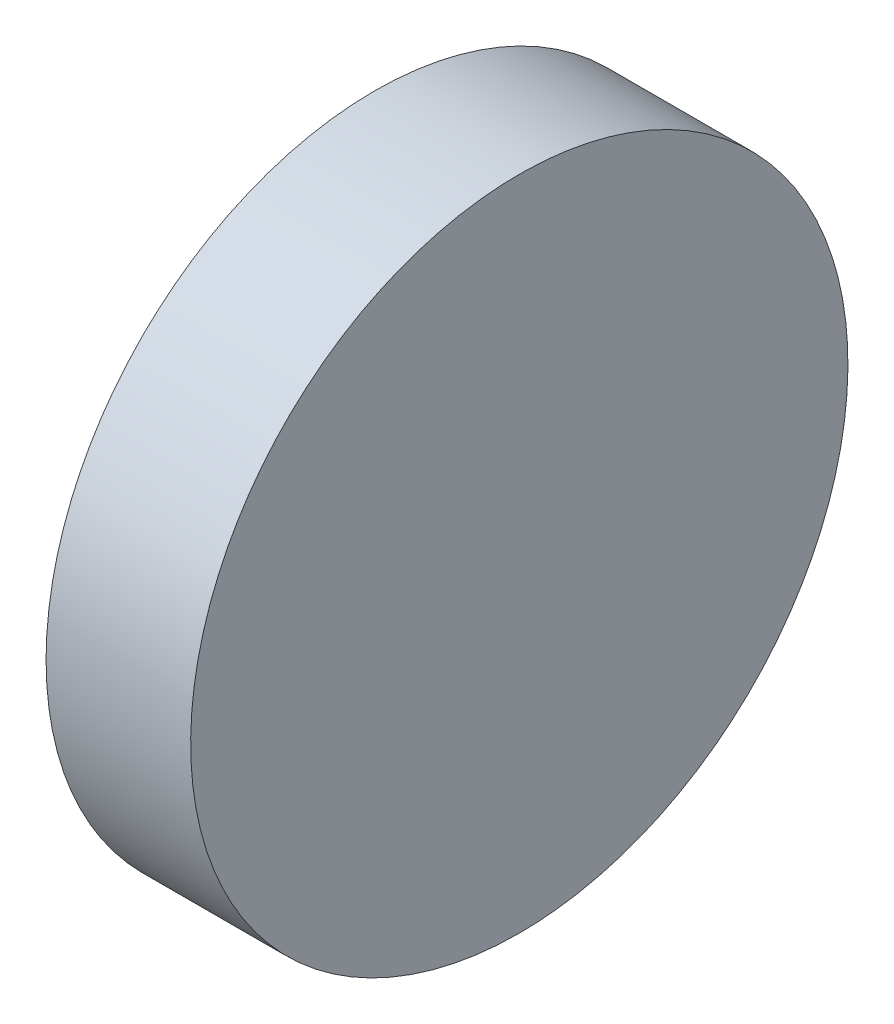
ISO-10303-21;
HEADER;
FILE_DESCRIPTION(('STEP AP214'),'2;1');
FILE_NAME('part.step','',(''),(''),'','','');
FILE_SCHEMA(('AUTOMOTIVE_DESIGN { 1 0 10303 214 1 1 1 1 }'));
ENDSEC;
DATA;
#1=APPLICATION_CONTEXT('core data for automotive mechanical design processes');
#2=APPLICATION_PROTOCOL_DEFINITION('international standard','automotive_design',2000,#1);
#3=PRODUCT_CONTEXT('',#1,'mechanical');
#4=PRODUCT('Part','Part','',(#3));
#5=PRODUCT_RELATED_PRODUCT_CATEGORY('part','',(#4));
#6=PRODUCT_DEFINITION_FORMATION('','',#4);
#7=PRODUCT_DEFINITION_CONTEXT('part definition',#1,'design');
#8=PRODUCT_DEFINITION('design','',#6,#7);
#9=PRODUCT_DEFINITION_SHAPE('','',#8);
#10=(LENGTH_UNIT() NAMED_UNIT(*) SI_UNIT(.MILLI.,.METRE.));
#11=(NAMED_UNIT(*) PLANE_ANGLE_UNIT() SI_UNIT($,.RADIAN.));
#12=(NAMED_UNIT(*) SI_UNIT($,.STERADIAN.) SOLID_ANGLE_UNIT());
#13=UNCERTAINTY_MEASURE_WITH_UNIT(LENGTH_MEASURE(1.E-05),#10,'distance_accuracy_value','');
#14=(GEOMETRIC_REPRESENTATION_CONTEXT(3) GLOBAL_UNCERTAINTY_ASSIGNED_CONTEXT((#13)) GLOBAL_UNIT_ASSIGNED_CONTEXT((#10,
#11,#12)) REPRESENTATION_CONTEXT('',''));
#15=CARTESIAN_POINT('',(0.,0.,0.));
#16=DIRECTION('',(0.,0.,1.));
#17=DIRECTION('',(1.,0.,0.));
#18=AXIS2_PLACEMENT_3D('',#15,#16,#17);
#19=CARTESIAN_POINT('',(-171.379588267492,-8.22627416997865,100.));
#20=CARTESIAN_POINT('',(-171.379588267492,-8.22627416997865,100.53840391905));
#21=CARTESIAN_POINT('',(-171.379588267492,-8.12021785485827,101.615211757149));
#22=CARTESIAN_POINT('',(-171.379588267492,-7.64907796388612,103.168351832291));
#23=CARTESIAN_POINT('',(-171.379588267492,-6.88398829641409,104.599733923351));
#24=CARTESIAN_POINT('',(-171.379588267492,-5.85435081929597,105.854350819297));
#25=CARTESIAN_POINT('',(-171.379588267492,-4.59973392335003,106.883988296415));
#26=CARTESIAN_POINT('',(-171.379588267492,-3.16835183229019,107.649077963887));
#27=CARTESIAN_POINT('',(-171.379588267492,-1.61521175714759,108.120217854859));
#28=CARTESIAN_POINT('',(-171.379588267492,1.04694070344487E-12,108.27930232754));
#29=CARTESIAN_POINT('',(-171.379588267492,1.61521175714969,108.120217854859));
#30=CARTESIAN_POINT('',(-171.379588267492,3.16835183229228,107.649077963887));
#31=CARTESIAN_POINT('',(-171.379588267492,4.59973392335212,106.883988296415));
#32=CARTESIAN_POINT('',(-171.379588267492,5.85435081929807,105.854350819297));
#33=CARTESIAN_POINT('',(-171.379588267492,6.88398829641619,104.599733923351));
#34=CARTESIAN_POINT('',(-171.379588267492,7.64907796388822,103.168351832291));
#35=CARTESIAN_POINT('',(-171.379588267492,8.12021785486037,101.615211757149));
#36=CARTESIAN_POINT('',(-171.379588267492,8.27930232754094,100.));
#37=CARTESIAN_POINT('',(-171.379588267492,8.12021785486037,98.3847882428513));
#38=CARTESIAN_POINT('',(-171.379588267492,7.64907796388822,96.8316481677087));
#39=CARTESIAN_POINT('',(-171.379588267492,6.88398829641619,95.4002660766489));
#40=CARTESIAN_POINT('',(-171.379588267492,5.85435081929807,94.145649180703));
#41=CARTESIAN_POINT('',(-171.379588267492,4.59973392335213,93.1160117035848));
#42=CARTESIAN_POINT('',(-171.379588267492,3.16835183229228,92.3509220361129));
#43=CARTESIAN_POINT('',(-171.379588267492,1.61521175714969,91.8797821451406));
#44=CARTESIAN_POINT('',(-171.379588267492,1.04604193531338E-12,91.7206976724601));
#45=CARTESIAN_POINT('',(-171.379588267492,-1.61521175714758,91.8797821451406));
#46=CARTESIAN_POINT('',(-171.379588267492,-3.16835183229019,92.3509220361128));
#47=CARTESIAN_POINT('',(-171.379588267492,-4.59973392335002,93.1160117035848));
#48=CARTESIAN_POINT('',(-171.379588267492,-5.85435081929598,94.145649180703));
#49=CARTESIAN_POINT('',(-171.379588267492,-6.88398829641409,95.4002660766489));
#50=CARTESIAN_POINT('',(-171.379588267492,-7.64907796388612,96.8316481677087));
#51=CARTESIAN_POINT('',(-171.379588267492,-8.12021785485827,98.3847882428514));
#52=CARTESIAN_POINT('',(-171.379588267492,-8.22627416997865,99.4615960809504));
#53=CARTESIAN_POINT('',(-171.379588267492,-8.22627416997865,100.));
#54=B_SPLINE_CURVE_WITH_KNOTS('',3,(#19,#20,#21,#22,#23,#24,#25,#26,#27,#28,#29,#30,#31,#32,#33,
#34,#35,#36,#37,#38,#39,#40,#41,#42,#43,#44,#45,#46,#47,#48,#49,#50,#51,#52,#53),.UNSPECIFIED.,
.T.,.F.,(4,1,1,1,1,1,1,1,1,1,1,1,1,1,1,1,1,1,1,1,1,1,1,1,1,1,1,1,1,1,1,1,4),(0.,
0.0312499999999999,0.0625000000000002,0.0937499999999998,0.125,0.15625,0.1875,0.21875,0.25,
0.28125,0.3125,0.34375,0.375,0.40625,0.4375,0.46875,0.5,0.53125,0.5625,0.59375,0.625,0.65625,
0.6875,0.71875,0.75,0.78125,0.8125,0.84375,0.875,0.90625,0.9375,0.96875,1.),.UNSPECIFIED.);
#55=DIRECTION('',(-1.,0.,0.));
#56=VECTOR('',#55,1.);
#57=SURFACE_OF_LINEAR_EXTRUSION('',#54,#56);
#58=CARTESIAN_POINT('',(-171.379588267492,-8.22627416997865,100.));
#59=CARTESIAN_POINT('',(-171.379588267492,-8.22627416997865,100.53840391905));
#60=CARTESIAN_POINT('',(-171.379588267492,-8.12021785485827,101.615211757149));
#61=CARTESIAN_POINT('',(-171.379588267492,-7.64907796388612,103.168351832291));
#62=CARTESIAN_POINT('',(-171.379588267492,-6.88398829641409,104.599733923351));
#63=CARTESIAN_POINT('',(-171.379588267492,-5.85435081929597,105.854350819297));
#64=CARTESIAN_POINT('',(-171.379588267492,-4.59973392335003,106.883988296415));
#65=CARTESIAN_POINT('',(-171.379588267492,-3.16835183229019,107.649077963887));
#66=CARTESIAN_POINT('',(-171.379588267492,-1.61521175714759,108.120217854859));
#67=CARTESIAN_POINT('',(-171.379588267492,1.04694070344487E-12,108.27930232754));
#68=CARTESIAN_POINT('',(-171.379588267492,1.61521175714969,108.120217854859));
#69=CARTESIAN_POINT('',(-171.379588267492,3.16835183229228,107.649077963887));
#70=CARTESIAN_POINT('',(-171.379588267492,4.59973392335212,106.883988296415));
#71=CARTESIAN_POINT('',(-171.379588267492,5.85435081929807,105.854350819297));
#72=CARTESIAN_POINT('',(-171.379588267492,6.88398829641619,104.599733923351));
#73=CARTESIAN_POINT('',(-171.379588267492,7.64907796388822,103.168351832291));
#74=CARTESIAN_POINT('',(-171.379588267492,8.12021785486037,101.615211757149));
#75=CARTESIAN_POINT('',(-171.379588267492,8.27930232754094,100.));
#76=CARTESIAN_POINT('',(-171.379588267492,8.12021785486037,98.3847882428513));
#77=CARTESIAN_POINT('',(-171.379588267492,7.64907796388822,96.8316481677087));
#78=CARTESIAN_POINT('',(-171.379588267492,6.88398829641619,95.4002660766489));
#79=CARTESIAN_POINT('',(-171.379588267492,5.85435081929807,94.145649180703));
#80=CARTESIAN_POINT('',(-171.379588267492,4.59973392335213,93.1160117035848));
#81=CARTESIAN_POINT('',(-171.379588267492,3.16835183229228,92.3509220361129));
#82=CARTESIAN_POINT('',(-171.379588267492,1.61521175714969,91.8797821451406));
#83=CARTESIAN_POINT('',(-171.379588267492,1.04604193531338E-12,91.7206976724601));
#84=CARTESIAN_POINT('',(-171.379588267492,-1.61521175714758,91.8797821451406));
#85=CARTESIAN_POINT('',(-171.379588267492,-3.16835183229019,92.3509220361128));
#86=CARTESIAN_POINT('',(-171.379588267492,-4.59973392335002,93.1160117035848));
#87=CARTESIAN_POINT('',(-171.379588267492,-5.85435081929598,94.145649180703));
#88=CARTESIAN_POINT('',(-171.379588267492,-6.88398829641409,95.4002660766489));
#89=CARTESIAN_POINT('',(-171.379588267492,-7.64907796388612,96.8316481677087));
#90=CARTESIAN_POINT('',(-171.379588267492,-8.12021785485827,98.3847882428514));
#91=CARTESIAN_POINT('',(-171.379588267492,-8.22627416997865,99.4615960809504));
#92=CARTESIAN_POINT('',(-171.379588267492,-8.22627416997865,100.));
#93=B_SPLINE_CURVE_WITH_KNOTS('',3,(#58,#59,#60,#61,#62,#63,#64,#65,#66,#67,#68,#69,#70,#71,#72,
#73,#74,#75,#76,#77,#78,#79,#80,#81,#82,#83,#84,#85,#86,#87,#88,#89,#90,#91,#92),.UNSPECIFIED.,
.T.,.F.,(4,1,1,1,1,1,1,1,1,1,1,1,1,1,1,1,1,1,1,1,1,1,1,1,1,1,1,1,1,1,1,1,4),(0.,
0.0312499999999999,0.0625000000000002,0.0937499999999998,0.125,0.15625,0.1875,0.21875,0.25,
0.28125,0.3125,0.34375,0.375,0.40625,0.4375,0.46875,0.5,0.53125,0.5625,0.59375,0.625,0.65625,
0.6875,0.71875,0.75,0.78125,0.8125,0.84375,0.875,0.90625,0.9375,0.96875,1.),.UNSPECIFIED.);
#94=CARTESIAN_POINT('',(-171.379588267492,-8.22627416997865,100.));
#95=VERTEX_POINT('',#94);
#96=EDGE_CURVE('E9',#95,#95,#93,.T.);
#97=ORIENTED_EDGE('',*,*,#96,.T.);
#98=EDGE_LOOP('',(#97));
#99=FACE_BOUND('',#98,.T.);
#100=CARTESIAN_POINT('',(-174.999,-8.22627416997865,100.));
#101=CARTESIAN_POINT('',(-174.999,-8.22627414205933,99.8653981937389));
#102=CARTESIAN_POINT('',(-174.999,-8.22295987055064,99.7307973670926));
#103=CARTESIAN_POINT('',(-174.999,-8.20973470024278,99.461919000039));
#104=CARTESIAN_POINT('',(-174.999,-8.19982375020194,99.3276414621511));
#105=CARTESIAN_POINT('',(-174.999,-8.17343708370963,99.0597331007838));
#106=CARTESIAN_POINT('',(-174.999,-8.15696136725815,98.9261022773044));
#107=CARTESIAN_POINT('',(-174.999,-8.11747680903288,98.6598099515152));
#108=CARTESIAN_POINT('',(-174.999,-8.09446801800827,98.527148441684));
#109=CARTESIAN_POINT('',(-174.999,-8.04194921894441,98.2631186046874));
#110=CARTESIAN_POINT('',(-174.999,-8.01243921090516,98.131750277522));
#111=CARTESIAN_POINT('',(-174.999,-7.94701251759616,97.87061814284));
#112=CARTESIAN_POINT('',(-174.999,-7.91109578256185,97.7408543477951));
#113=CARTESIAN_POINT('',(-174.999,-7.8329498197329,97.4832416321854));
#114=CARTESIAN_POINT('',(-174.999,-7.79072059193825,97.3553927116206));
#115=CARTESIAN_POINT('',(-174.999,-7.7000436575456,97.1019201523597));
#116=CARTESIAN_POINT('',(-174.999,-7.6515959992542,96.9762964963857));
#117=CARTESIAN_POINT('',(-174.999,-7.54857666968475,96.7275858337261));
#118=CARTESIAN_POINT('',(-174.999,-7.49400499840669,96.6044988270404));
#119=CARTESIAN_POINT('',(-174.999,-7.37889110803985,96.3611483862609));
#120=CARTESIAN_POINT('',(-174.999,-7.31834884257581,96.2408849741076));
#121=CARTESIAN_POINT('',(-174.999,-7.19144668496832,96.0034677360499));
#122=CARTESIAN_POINT('',(-174.999,-7.12508679282486,95.8863139101454));
#123=CARTESIAN_POINT('',(-174.999,-6.9867021470647,95.655401947258));
#124=CARTESIAN_POINT('',(-174.999,-6.91467743745568,95.5416437839049));
#125=CARTESIAN_POINT('',(-174.999,-6.76511655215715,95.3178101010976));
#126=CARTESIAN_POINT('',(-174.999,-6.68758037646764,95.2077345816434));
#127=CARTESIAN_POINT('',(-174.999,-6.52720305136949,94.9915176572796));
#128=CARTESIAN_POINT('',(-174.999,-6.44436186075708,94.8853762829364));
#129=CARTESIAN_POINT('',(-174.999,-6.27358028709991,94.6772783333297));
#130=CARTESIAN_POINT('',(-174.999,-6.18563990405515,94.5753217580661));
#131=CARTESIAN_POINT('',(-174.999,-6.00486559126254,94.3758442088999));
#132=CARTESIAN_POINT('',(-174.999,-5.91203169953222,94.2783232005485));
#133=CARTESIAN_POINT('',(-174.999,-5.72167679945045,94.0879683004667));
#134=CARTESIAN_POINT('',(-174.999,-5.624155791099,93.9951344087364));
#135=CARTESIAN_POINT('',(-174.999,-5.42467824193281,93.8143600959438));
#136=CARTESIAN_POINT('',(-174.999,-5.32272166666924,93.726419712899));
#137=CARTESIAN_POINT('',(-174.999,-5.11462371706252,93.5556381392419));
#138=CARTESIAN_POINT('',(-174.999,-5.00848234271936,93.4727969486294));
#139=CARTESIAN_POINT('',(-174.999,-4.79226541835554,93.3124196235313));
#140=CARTESIAN_POINT('',(-174.999,-4.68218989890128,93.2348834478418));
#141=CARTESIAN_POINT('',(-174.999,-4.45835621609415,93.0853225625432));
#142=CARTESIAN_POINT('',(-174.999,-4.34459805274128,93.0132978529342));
#143=CARTESIAN_POINT('',(-174.999,-4.11368608985322,92.8749132071741));
#144=CARTESIAN_POINT('',(-174.999,-3.99653226394796,92.8085533150306));
#145=CARTESIAN_POINT('',(-174.999,-3.75911502589239,92.6816511574232));
#146=CARTESIAN_POINT('',(-174.999,-3.63885161374208,92.6211088919593));
#147=CARTESIAN_POINT('',(-174.999,-3.3955011729545,92.505995001592));
#148=CARTESIAN_POINT('',(-174.999,-3.27241416625786,92.4514233303134));
#149=CARTESIAN_POINT('',(-174.999,-3.02370350362827,92.3484040007455));
#150=CARTESIAN_POINT('',(-174.999,-2.89807984769534,92.2999563424561));
#151=CARTESIAN_POINT('',(-174.999,-2.64460728832227,92.2092794080579));
#152=CARTESIAN_POINT('',(-174.999,-2.51675836760424,92.1670501802557));
#153=CARTESIAN_POINT('',(-174.999,-2.25914565241318,92.0889042174474));
#154=CARTESIAN_POINT('',(-174.999,-2.12938185794015,92.0529874824413));
#155=CARTESIAN_POINT('',(-174.999,-1.86824972169578,91.9875607890552));
#156=CARTESIAN_POINT('',(-174.999,-1.73688139239612,91.9580507809106));
#157=CARTESIAN_POINT('',(-174.999,-1.47285156123039,91.9055319821345));
#158=CARTESIAN_POINT('',(-174.999,-1.34019005936432,91.8825231915031));
#159=CARTESIAN_POINT('',(-174.999,-1.0738977118139,91.8430386322036));
#160=CARTESIAN_POINT('',(-174.999,-0.940266858607795,91.8265629142847));
#161=CARTESIAN_POINT('',(-174.999,-0.672358578455166,91.8001762518015));
#162=CARTESIAN_POINT('',(-174.999,-0.538081151508645,91.7902653072372));
#163=CARTESIAN_POINT('',(-174.999,-0.269202481358767,91.7770401219673));
#164=CARTESIAN_POINT('',(-174.999,-0.134601240678862,91.7737258300203));
#165=CARTESIAN_POINT('',(-174.999,0.13460124068095,91.7737258300203));
#166=CARTESIAN_POINT('',(-174.999,0.269202481360855,91.7770401219673));
#167=CARTESIAN_POINT('',(-174.999,0.538081151510734,91.7902653072372));
#168=CARTESIAN_POINT('',(-174.999,0.672358578457255,91.8001762518015));
#169=CARTESIAN_POINT('',(-174.999,0.940266858609885,91.8265629142847));
#170=CARTESIAN_POINT('',(-174.999,1.07389771181599,91.8430386322036));
#171=CARTESIAN_POINT('',(-174.999,1.34019005936642,91.8825231915031));
#172=CARTESIAN_POINT('',(-174.999,1.47285156123248,91.9055319821346));
#173=CARTESIAN_POINT('',(-174.999,1.73688139239821,91.9580507809106));
#174=CARTESIAN_POINT('',(-174.999,1.86824972169787,91.9875607890552));
#175=CARTESIAN_POINT('',(-174.999,2.12938185794224,92.0529874824413));
#176=CARTESIAN_POINT('',(-174.999,2.25914565241527,92.0889042174474));
#177=CARTESIAN_POINT('',(-174.999,2.51675836760633,92.1670501802557));
#178=CARTESIAN_POINT('',(-174.999,2.64460728832435,92.2092794080579));
#179=CARTESIAN_POINT('',(-174.999,2.89807984769743,92.2999563424561));
#180=CARTESIAN_POINT('',(-174.999,3.02370350363036,92.3484040007455));
#181=CARTESIAN_POINT('',(-174.999,3.27241416625994,92.4514233303135));
#182=CARTESIAN_POINT('',(-174.999,3.39550117295659,92.5059950015921));
#183=CARTESIAN_POINT('',(-174.999,3.63885161374417,92.6211088919593));
#184=CARTESIAN_POINT('',(-174.999,3.75911502589448,92.6816511574232));
#185=CARTESIAN_POINT('',(-174.999,3.99653226395006,92.8085533150306));
#186=CARTESIAN_POINT('',(-174.999,4.11368608985531,92.874913207174));
#187=CARTESIAN_POINT('',(-174.999,4.34459805274338,93.0132978529342));
#188=CARTESIAN_POINT('',(-174.999,4.45835621609624,93.0853225625432));
#189=CARTESIAN_POINT('',(-174.999,4.68218989890337,93.2348834478418));
#190=CARTESIAN_POINT('',(-174.999,4.79226541835763,93.3124196235313));
#191=CARTESIAN_POINT('',(-174.999,5.00848234272146,93.4727969486294));
#192=CARTESIAN_POINT('',(-174.999,5.11462371706461,93.5556381392418));
#193=CARTESIAN_POINT('',(-174.999,5.32272166667134,93.726419712899));
#194=CARTESIAN_POINT('',(-174.999,5.42467824193491,93.8143600959438));
#195=CARTESIAN_POINT('',(-174.999,5.62415579110109,93.9951344087364));
#196=CARTESIAN_POINT('',(-174.999,5.72167679945255,94.0879683004667));
#197=CARTESIAN_POINT('',(-174.999,5.91203169953431,94.2783232005485));
#198=CARTESIAN_POINT('',(-174.999,6.00486559126462,94.3758442088999));
#199=CARTESIAN_POINT('',(-174.999,6.18563990405723,94.5753217580661));
#200=CARTESIAN_POINT('',(-174.999,6.273580287102,94.6772783333297));
#201=CARTESIAN_POINT('',(-174.999,6.44436186075918,94.8853762829364));
#202=CARTESIAN_POINT('',(-174.999,6.52720305137158,94.9915176572796));
#203=CARTESIAN_POINT('',(-174.999,6.68758037646974,95.2077345816434));
#204=CARTESIAN_POINT('',(-174.999,6.76511655215924,95.3178101010977));
#205=CARTESIAN_POINT('',(-174.999,6.91467743745777,95.5416437839048));
#206=CARTESIAN_POINT('',(-174.999,6.98670214706679,95.6554019472576));
#207=CARTESIAN_POINT('',(-174.999,7.12508679282698,95.8863139101457));
#208=CARTESIAN_POINT('',(-174.999,7.19144668497047,96.003467736051));
#209=CARTESIAN_POINT('',(-174.999,7.31834884257785,96.2408849741065));
#210=CARTESIAN_POINT('',(-174.999,7.37889110804174,96.3611483862569));
#211=CARTESIAN_POINT('',(-174.999,7.49400499840898,96.6044988270444));
#212=CARTESIAN_POINT('',(-174.999,7.54857666968758,96.7275858337411));
#213=CARTESIAN_POINT('',(-174.999,7.65159599925556,96.9762964963707));
#214=CARTESIAN_POINT('',(-174.999,7.70004365754492,97.1019201523036));
#215=CARTESIAN_POINT('',(-174.999,7.79072059194312,97.3553927116767));
#216=CARTESIAN_POINT('',(-174.999,7.83294981974533,97.4832416323947));
#217=CARTESIAN_POINT('',(-174.999,7.91109578255362,97.7408543475857));
#218=CARTESIAN_POINT('',(-174.999,7.9470125175597,97.8706181420588));
#219=CARTESIAN_POINT('',(-174.999,8.01243921094582,98.1317502783031));
#220=CARTESIAN_POINT('',(-174.999,8.04194921909043,98.2631186076028));
#221=CARTESIAN_POINT('',(-174.999,8.09446801786645,98.5271484387685));
#222=CARTESIAN_POINT('',(-174.999,8.11747680849787,98.6598099406346));
#223=CARTESIAN_POINT('',(-174.999,8.15696136779736,98.926102288185));
#224=CARTESIAN_POINT('',(-174.999,8.17343708571627,99.0597331413911));
#225=CARTESIAN_POINT('',(-174.999,8.19982374819951,99.3276414215437));
#226=CARTESIAN_POINT('',(-174.999,8.20973469276384,99.4619188484903));
#227=CARTESIAN_POINT('',(-174.999,8.22295987803373,99.7307975186402));
#228=CARTESIAN_POINT('',(-174.999,8.22627416998075,99.8653987593201));
#229=CARTESIAN_POINT('',(-174.999,8.22627416998075,100.13460124068));
#230=CARTESIAN_POINT('',(-174.999,8.22295987803373,100.26920248136));
#231=CARTESIAN_POINT('',(-174.999,8.20973469276384,100.53808115151));
#232=CARTESIAN_POINT('',(-174.999,8.19982374819951,100.672358578456));
#233=CARTESIAN_POINT('',(-174.999,8.17343708571627,100.940266858609));
#234=CARTESIAN_POINT('',(-174.999,8.15696136779737,101.073897711815));
#235=CARTESIAN_POINT('',(-174.999,8.11747680849787,101.340190059365));
#236=CARTESIAN_POINT('',(-174.999,8.09446801786645,101.472851561231));
#237=CARTESIAN_POINT('',(-174.999,8.04194921909042,101.736881392397));
#238=CARTESIAN_POINT('',(-174.999,8.01243921094582,101.868249721697));
#239=CARTESIAN_POINT('',(-174.999,7.9470125175597,102.129381857941));
#240=CARTESIAN_POINT('',(-174.999,7.91109578255362,102.259145652414));
#241=CARTESIAN_POINT('',(-174.999,7.83294981974533,102.516758367605));
#242=CARTESIAN_POINT('',(-174.999,7.79072059194312,102.644607288323));
#243=CARTESIAN_POINT('',(-174.999,7.70004365754493,102.898079847696));
#244=CARTESIAN_POINT('',(-174.999,7.65159599925556,103.023703503629));
#245=CARTESIAN_POINT('',(-174.999,7.54857666968758,103.272414166259));
#246=CARTESIAN_POINT('',(-174.999,7.49400499840898,103.395501172956));
#247=CARTESIAN_POINT('',(-174.999,7.37889110804174,103.638851613743));
#248=CARTESIAN_POINT('',(-174.999,7.31834884257785,103.759115025893));
#249=CARTESIAN_POINT('',(-174.999,7.19144668497046,103.996532263949));
#250=CARTESIAN_POINT('',(-174.999,7.12508679282697,104.113686089854));
#251=CARTESIAN_POINT('',(-174.999,6.98670214706678,104.344598052742));
#252=CARTESIAN_POINT('',(-174.999,6.91467743745777,104.458356216095));
#253=CARTESIAN_POINT('',(-174.999,6.76511655215924,104.682189898902));
#254=CARTESIAN_POINT('',(-174.999,6.68758037646973,104.792265418357));
#255=CARTESIAN_POINT('',(-174.999,6.52720305137157,105.00848234272));
#256=CARTESIAN_POINT('',(-174.999,6.44436186075917,105.114623717064));
#257=CARTESIAN_POINT('',(-174.999,6.273580287102,105.32272166667));
#258=CARTESIAN_POINT('',(-174.999,6.18563990405723,105.424678241934));
#259=CARTESIAN_POINT('',(-174.999,6.00486559126462,105.6241557911));
#260=CARTESIAN_POINT('',(-174.999,5.91203169953431,105.721676799451));
#261=CARTESIAN_POINT('',(-174.999,5.72167679945254,105.912031699533));
#262=CARTESIAN_POINT('',(-174.999,5.62415579110109,106.004865591264));
#263=CARTESIAN_POINT('',(-174.999,5.4246782419349,106.185639904056));
#264=CARTESIAN_POINT('',(-174.999,5.32272166667133,106.273580287101));
#265=CARTESIAN_POINT('',(-174.999,5.11462371706461,106.444361860758));
#266=CARTESIAN_POINT('',(-174.999,5.00848234272145,106.527203051371));
#267=CARTESIAN_POINT('',(-174.999,4.79226541835763,106.687580376469));
#268=CARTESIAN_POINT('',(-174.999,4.68218989890336,106.765116552158));
#269=CARTESIAN_POINT('',(-174.999,4.45835621609624,106.914677437457));
#270=CARTESIAN_POINT('',(-174.999,4.34459805274338,106.986702147066));
#271=CARTESIAN_POINT('',(-174.999,4.11368608985531,107.125086792826));
#272=CARTESIAN_POINT('',(-174.999,3.99653226395005,107.191446684969));
#273=CARTESIAN_POINT('',(-174.999,3.75911502589448,107.318348842577));
#274=CARTESIAN_POINT('',(-174.999,3.63885161374417,107.378891108041));
#275=CARTESIAN_POINT('',(-174.999,3.39550117295659,107.494004998408));
#276=CARTESIAN_POINT('',(-174.999,3.27241416625994,107.548576669686));
#277=CARTESIAN_POINT('',(-174.999,3.02370350363036,107.651595999254));
#278=CARTESIAN_POINT('',(-174.999,2.89807984769743,107.700043657544));
#279=CARTESIAN_POINT('',(-174.999,2.64460728832436,107.790720591942));
#280=CARTESIAN_POINT('',(-174.999,2.51675836760632,107.832949819744));
#281=CARTESIAN_POINT('',(-174.999,2.25914565241527,107.911095782553));
#282=CARTESIAN_POINT('',(-174.999,2.12938185794224,107.947012517559));
#283=CARTESIAN_POINT('',(-174.999,1.86824972169787,108.012439210945));
#284=CARTESIAN_POINT('',(-174.999,1.73688139239821,108.041949219089));
#285=CARTESIAN_POINT('',(-174.999,1.47285156123248,108.094468017865));
#286=CARTESIAN_POINT('',(-174.999,1.34019005936642,108.117476808497));
#287=CARTESIAN_POINT('',(-174.999,1.07389771181599,108.156961367796));
#288=CARTESIAN_POINT('',(-174.999,0.940266858609887,108.173437085715));
#289=CARTESIAN_POINT('',(-174.999,0.672358578457258,108.199823748198));
#290=CARTESIAN_POINT('',(-174.999,0.538081151510736,108.209734692763));
#291=CARTESIAN_POINT('',(-174.999,0.269202481360857,108.222959878033));
#292=CARTESIAN_POINT('',(-174.999,0.134601240680951,108.22627416998));
#293=CARTESIAN_POINT('',(-174.999,-0.134601240678861,108.22627416998));
#294=CARTESIAN_POINT('',(-174.999,-0.269202481358767,108.222959878033));
#295=CARTESIAN_POINT('',(-174.999,-0.538081151508646,108.209734692763));
#296=CARTESIAN_POINT('',(-174.999,-0.672358578455167,108.199823748198));
#297=CARTESIAN_POINT('',(-174.999,-0.940266858607797,108.173437085715));
#298=CARTESIAN_POINT('',(-174.999,-1.0738977118139,108.156961367796));
#299=CARTESIAN_POINT('',(-174.999,-1.34019005936433,108.117476808497));
#300=CARTESIAN_POINT('',(-174.999,-1.47285156123039,108.094468017865));
#301=CARTESIAN_POINT('',(-174.999,-1.73688139239612,108.041949219089));
#302=CARTESIAN_POINT('',(-174.999,-1.86824972169578,108.012439210945));
#303=CARTESIAN_POINT('',(-174.999,-2.12938185794015,107.947012517559));
#304=CARTESIAN_POINT('',(-174.999,-2.25914565241318,107.911095782553));
#305=CARTESIAN_POINT('',(-174.999,-2.51675836760424,107.832949819744));
#306=CARTESIAN_POINT('',(-174.999,-2.64460728832227,107.790720591942));
#307=CARTESIAN_POINT('',(-174.999,-2.89807984769534,107.700043657544));
#308=CARTESIAN_POINT('',(-174.999,-3.02370350362827,107.651595999254));
#309=CARTESIAN_POINT('',(-174.999,-3.27241416625785,107.548576669687));
#310=CARTESIAN_POINT('',(-174.999,-3.3955011729545,107.494004998408));
#311=CARTESIAN_POINT('',(-174.999,-3.63885161374208,107.378891108041));
#312=CARTESIAN_POINT('',(-174.999,-3.75911502589239,107.318348842577));
#313=CARTESIAN_POINT('',(-174.999,-3.99653226394796,107.191446684969));
#314=CARTESIAN_POINT('',(-174.999,-4.11368608985322,107.125086792826));
#315=CARTESIAN_POINT('',(-174.999,-4.34459805274129,106.986702147066));
#316=CARTESIAN_POINT('',(-174.999,-4.45835621609415,106.914677437457));
#317=CARTESIAN_POINT('',(-174.999,-4.68218989890127,106.765116552158));
#318=CARTESIAN_POINT('',(-174.999,-4.79226541835554,106.687580376469));
#319=CARTESIAN_POINT('',(-174.999,-5.00848234271936,106.527203051371));
#320=CARTESIAN_POINT('',(-174.999,-5.11462371706252,106.444361860758));
#321=CARTESIAN_POINT('',(-174.999,-5.32272166666924,106.273580287101));
#322=CARTESIAN_POINT('',(-174.999,-5.42467824193281,106.185639904056));
#323=CARTESIAN_POINT('',(-174.999,-5.624155791099,106.004865591264));
#324=CARTESIAN_POINT('',(-174.999,-5.72167679945045,105.912031699533));
#325=CARTESIAN_POINT('',(-174.999,-5.91203169953222,105.721676799452));
#326=CARTESIAN_POINT('',(-174.999,-6.00486559126253,105.6241557911));
#327=CARTESIAN_POINT('',(-174.999,-6.18563990405514,105.424678241934));
#328=CARTESIAN_POINT('',(-174.999,-6.2735802870999,105.32272166667));
#329=CARTESIAN_POINT('',(-174.999,-6.44436186075708,105.114623717064));
#330=CARTESIAN_POINT('',(-174.999,-6.52720305136949,105.00848234272));
#331=CARTESIAN_POINT('',(-174.999,-6.68758037646764,104.792265418357));
#332=CARTESIAN_POINT('',(-174.999,-6.76511655215714,104.682189898902));
#333=CARTESIAN_POINT('',(-174.999,-6.91467743745567,104.458356216095));
#334=CARTESIAN_POINT('',(-174.999,-6.9867021470647,104.344598052742));
#335=CARTESIAN_POINT('',(-174.999,-7.12508679282486,104.113686089855));
#336=CARTESIAN_POINT('',(-174.999,-7.19144668496832,103.99653226395));
#337=CARTESIAN_POINT('',(-174.999,-7.31834884257581,103.759115025892));
#338=CARTESIAN_POINT('',(-174.999,-7.37889110803984,103.638851613739));
#339=CARTESIAN_POINT('',(-174.999,-7.49400499840668,103.39550117296));
#340=CARTESIAN_POINT('',(-174.999,-7.54857666968475,103.272414166274));
#341=CARTESIAN_POINT('',(-174.999,-7.6515959992542,103.023703503614));
#342=CARTESIAN_POINT('',(-174.999,-7.7000436575456,102.89807984764));
#343=CARTESIAN_POINT('',(-174.999,-7.79072059193825,102.644607288379));
#344=CARTESIAN_POINT('',(-174.999,-7.8329498197329,102.516758367815));
#345=CARTESIAN_POINT('',(-174.999,-7.91109578256185,102.259145652205));
#346=CARTESIAN_POINT('',(-174.999,-7.94701251759616,102.12938185716));
#347=CARTESIAN_POINT('',(-174.999,-8.01243921090516,101.868249722478));
#348=CARTESIAN_POINT('',(-174.999,-8.04194921894441,101.736881395313));
#349=CARTESIAN_POINT('',(-174.999,-8.09446801800827,101.472851558316));
#350=CARTESIAN_POINT('',(-174.999,-8.11747680903288,101.340190048485));
#351=CARTESIAN_POINT('',(-174.999,-8.15696136725815,101.073897722696));
#352=CARTESIAN_POINT('',(-174.999,-8.17343708370963,100.940266899216));
#353=CARTESIAN_POINT('',(-174.999,-8.19982375020195,100.672358537849));
#354=CARTESIAN_POINT('',(-174.999,-8.20973470024278,100.538080999961));
#355=CARTESIAN_POINT('',(-174.999,-8.22295987055065,100.269202632907));
#356=CARTESIAN_POINT('',(-174.999,-8.22627414205934,100.134601806261));
#357=CARTESIAN_POINT('',(-174.999,-8.22627416997865,100.));
#358=B_SPLINE_CURVE_WITH_KNOTS('',3,(#100,#101,#102,#103,#104,#105,#106,#107,#108,#109,#110,
#111,#112,#113,#114,#115,#116,#117,#118,#119,#120,#121,#122,#123,#124,#125,#126,#127,#128,#129,
#130,#131,#132,#133,#134,#135,#136,#137,#138,#139,#140,#141,#142,#143,#144,#145,#146,#147,#148,
#149,#150,#151,#152,#153,#154,#155,#156,#157,#158,#159,#160,#161,#162,#163,#164,#165,#166,#167,
#168,#169,#170,#171,#172,#173,#174,#175,#176,#177,#178,#179,#180,#181,#182,#183,#184,#185,#186,
#187,#188,#189,#190,#191,#192,#193,#194,#195,#196,#197,#198,#199,#200,#201,#202,#203,#204,#205,
#206,#207,#208,#209,#210,#211,#212,#213,#214,#215,#216,#217,#218,#219,#220,#221,#222,#223,#224,
#225,#226,#227,#228,#229,#230,#231,#232,#233,#234,#235,#236,#237,#238,#239,#240,#241,#242,#243,
#244,#245,#246,#247,#248,#249,#250,#251,#252,#253,#254,#255,#256,#257,#258,#259,#260,#261,#262,
#263,#264,#265,#266,#267,#268,#269,#270,#271,#272,#273,#274,#275,#276,#277,#278,#279,#280,#281,
#282,#283,#284,#285,#286,#287,#288,#289,#290,#291,#292,#293,#294,#295,#296,#297,#298,#299,#300,
#301,#302,#303,#304,#305,#306,#307,#308,#309,#310,#311,#312,#313,#314,#315,#316,#317,#318,#319,
#320,#321,#322,#323,#324,#325,#326,#327,#328,#329,#330,#331,#332,#333,#334,#335,#336,#337,#338,
#339,#340,#341,#342,#343,#344,#345,#346,#347,#348,#349,#350,#351,#352,#353,#354,#355,#356,#357),
.UNSPECIFIED.,.F.,.F.,(4,2,2,2,2,2,2,2,2,2,2,2,2,2,2,2,2,2,2,2,2,2,2,2,2,2,2,2,2,2,2,2,2,2,2,2,
2,2,2,2,2,2,2,2,2,2,2,2,2,2,2,2,2,2,2,2,2,2,2,2,2,2,2,2,2,2,2,2,2,2,2,2,2,2,2,2,2,2,2,2,2,2,2,2,
2,2,2,2,2,2,2,2,2,2,2,2,2,2,2,2,2,2,2,2,2,2,2,2,2,2,2,2,2,2,2,2,2,2,2,2,2,2,2,2,2,2,2,2,4),(0.,
0.403763342785342,0.807529821959066,1.21129630113282,1.61505964391816,2.0188229867035,
2.42258946587726,2.826355945051,3.23011928783635,3.63388263062171,4.03764910979545,
4.44141558896917,4.84517893175452,5.24894227453988,5.65270875371361,6.05647523288736,
6.4602385756727,6.86400191845806,7.2677683976318,7.67153487680555,8.0752982195909,
8.47906156237624,8.88282804154999,9.28659452072373,9.69035786350908,10.0941212062944,
10.4978876854682,10.9016541646419,11.3054175074273,11.7091808502126,12.1129473293864,
12.5167138085601,12.9204771513454,13.3242404941308,13.7280069733045,14.1317734524783,
14.5355367952636,14.939300138049,15.3430666172227,15.7468330963965,16.1505964391818,
16.5543597819672,16.9581262611409,17.3618927403146,17.7656560831,18.1694194258853,
18.5731859050591,18.9769523842328,19.3807157270182,19.7844790698035,20.1882455489773,
20.592012028151,20.9957753709364,21.3995387137217,21.8033051928954,22.2070716720692,
22.6108350148546,23.0145983576399,23.4183648368136,23.8221313159874,24.2258946587727,
24.6296580015581,25.0334244807318,25.4371909599056,25.8409543026909,26.2447176454763,
26.64848412465,27.0522506038238,27.4560139466091,27.8597772893945,28.2635437685682,
28.6673102477419,29.0710735905273,29.4748369333126,29.8786034124864,30.2823698916601,
30.6861332344455,31.0898965772308,31.4936630564046,31.8974295355783,32.3011928783636,
32.704956221149,33.1087227003227,33.5124891794965,33.9162525222818,34.3200158650672,
34.7237823442409,35.1275488234147,35.5313121662,35.9350755089854,36.3388419881591,
36.7426084673329,37.1463718101182,37.5501351529036,37.9539016320773,38.357668111251,
38.7614314540364,39.1651947968217,39.5689612759955,39.9727277551692,40.3764910979546,
40.7802544407399,41.1840209199137,41.5877873990874,41.9915507418728,42.3953140846581,
42.7990805638318,43.2028470430056,43.6066103857909,44.0103737285763,44.41414020775,
44.8179066869238,45.2216700297091,45.6254333724945,46.0291998516682,46.4329663308419,
46.8367296736273,47.2404930164126,47.6442594955864,48.0480259747602,48.4517893175455,
48.8555526603308,49.2593191395046,49.6630856186783,50.0668489614637,50.470612304249,
50.8743787834228,51.2781452625965,51.6819086053819),.UNSPECIFIED.);
#359=CARTESIAN_POINT('',(-174.999,-8.22627416997865,100.));
#360=VERTEX_POINT('',#359);
#361=EDGE_CURVE('E24',#360,#360,#358,.F.);
#362=ORIENTED_EDGE('',*,*,#361,.F.);
#363=EDGE_LOOP('',(#362));
#364=FACE_BOUND('',#363,.T.);
#365=ADVANCED_FACE('F14',(#99,#364),#57,.T.);
#366=CARTESIAN_POINT('',(-171.379588267492,0.,-62.5));
#367=DIRECTION('',(-1.,0.,0.));
#368=DIRECTION('',(0.,-1.,0.));
#369=AXIS2_PLACEMENT_3D('',#366,#367,#368);
#370=PLANE('',#369);
#371=ORIENTED_EDGE('',*,*,#96,.F.);
#372=EDGE_LOOP('',(#371));
#373=FACE_BOUND('',#372,.T.);
#374=ADVANCED_FACE('F62',(#373),#370,.F.);
#375=CARTESIAN_POINT('',(-174.999,0.,-62.5));
#376=DIRECTION('',(-1.,0.,0.));
#377=DIRECTION('',(0.,-1.,0.));
#378=AXIS2_PLACEMENT_3D('',#375,#376,#377);
#379=PLANE('',#378);
#380=ORIENTED_EDGE('',*,*,#361,.T.);
#381=EDGE_LOOP('',(#380));
#382=FACE_BOUND('',#381,.T.);
#383=ADVANCED_FACE('F31',(#382),#379,.T.);
#384=CLOSED_SHELL('',(#365,#374,#383));
#385=MANIFOLD_SOLID_BREP('B1',#384);
#386=ADVANCED_BREP_SHAPE_REPRESENTATION('',(#18,#385),#14);
#387=SHAPE_DEFINITION_REPRESENTATION(#9,#386);
ENDSEC;
END-ISO-10303-21;
